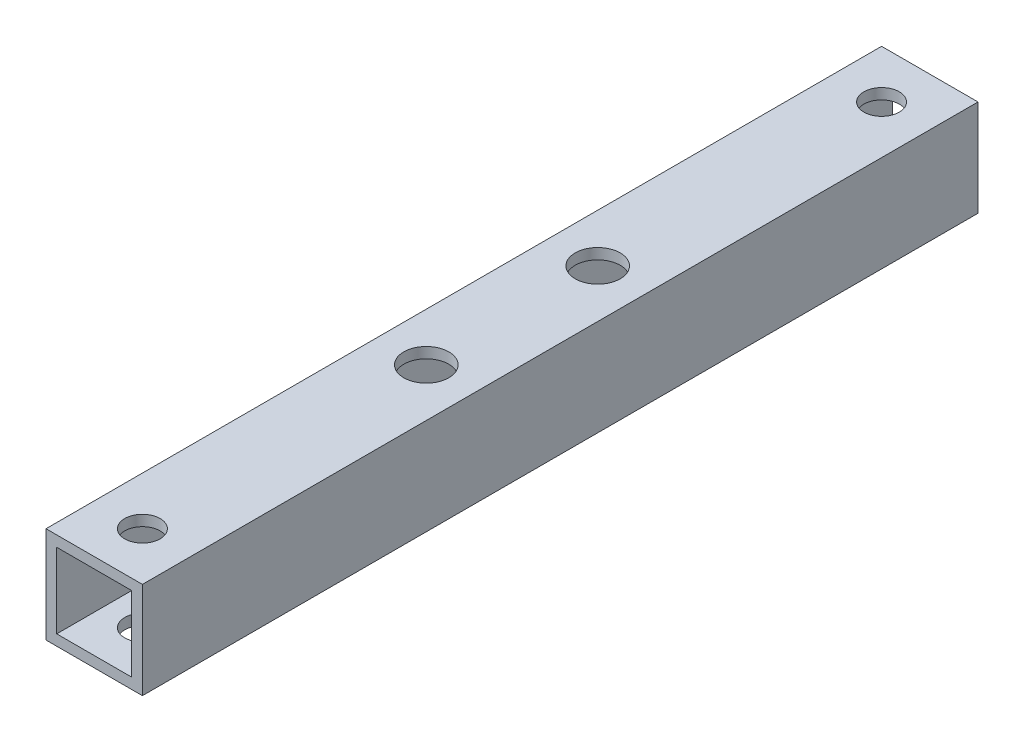
ISO-10303-21;
HEADER;
FILE_DESCRIPTION(('STEP AP214'),'2;1');
FILE_NAME('part.step','',(''),(''),'','','');
FILE_SCHEMA(('AUTOMOTIVE_DESIGN { 1 0 10303 214 1 1 1 1 }'));
ENDSEC;
DATA;
#1=APPLICATION_CONTEXT('core data for automotive mechanical design processes');
#2=APPLICATION_PROTOCOL_DEFINITION('international standard','automotive_design',2000,#1);
#3=PRODUCT_CONTEXT('',#1,'mechanical');
#4=PRODUCT('Part','Part','',(#3));
#5=PRODUCT_RELATED_PRODUCT_CATEGORY('part','',(#4));
#6=PRODUCT_DEFINITION_FORMATION('','',#4);
#7=PRODUCT_DEFINITION_CONTEXT('part definition',#1,'design');
#8=PRODUCT_DEFINITION('design','',#6,#7);
#9=PRODUCT_DEFINITION_SHAPE('','',#8);
#10=(LENGTH_UNIT() NAMED_UNIT(*) SI_UNIT(.MILLI.,.METRE.));
#11=(NAMED_UNIT(*) PLANE_ANGLE_UNIT() SI_UNIT($,.RADIAN.));
#12=(NAMED_UNIT(*) SI_UNIT($,.STERADIAN.) SOLID_ANGLE_UNIT());
#13=UNCERTAINTY_MEASURE_WITH_UNIT(LENGTH_MEASURE(1.E-05),#10,'distance_accuracy_value','');
#14=(GEOMETRIC_REPRESENTATION_CONTEXT(3) GLOBAL_UNCERTAINTY_ASSIGNED_CONTEXT((#13)) GLOBAL_UNIT_ASSIGNED_CONTEXT((#10,
#11,#12)) REPRESENTATION_CONTEXT('',''));
#15=CARTESIAN_POINT('',(0.,0.,0.));
#16=DIRECTION('',(0.,0.,1.));
#17=DIRECTION('',(1.,0.,0.));
#18=AXIS2_PLACEMENT_3D('',#15,#16,#17);
#19=CARTESIAN_POINT('',(4.5,4.5,78.));
#20=DIRECTION('',(-1.,0.,0.));
#21=DIRECTION('',(0.,0.,1.));
#22=AXIS2_PLACEMENT_3D('',#19,#20,#21);
#23=PLANE('',#22);
#24=DIRECTION('',(0.,1.,0.));
#25=VECTOR('',#24,1.);
#26=CARTESIAN_POINT('',(4.5,4.5,0.));
#27=LINE('',#26,#25);
#28=CARTESIAN_POINT('',(4.5,-4.5,0.));
#29=VERTEX_POINT('',#28);
#30=CARTESIAN_POINT('',(4.5,4.5,0.));
#31=VERTEX_POINT('',#30);
#32=EDGE_CURVE('E125',#29,#31,#27,.T.);
#33=ORIENTED_EDGE('',*,*,#32,.T.);
#34=DIRECTION('',(0.,0.,-1.));
#35=VECTOR('',#34,1.);
#36=CARTESIAN_POINT('',(4.5,4.5,78.));
#37=LINE('',#36,#35);
#38=CARTESIAN_POINT('',(4.5,4.5,78.));
#39=VERTEX_POINT('',#38);
#40=EDGE_CURVE('E154',#39,#31,#37,.T.);
#41=ORIENTED_EDGE('',*,*,#40,.F.);
#42=DIRECTION('',(0.,1.,0.));
#43=VECTOR('',#42,1.);
#44=CARTESIAN_POINT('',(4.5,4.5,78.));
#45=LINE('',#44,#43);
#46=CARTESIAN_POINT('',(4.5,-4.5,78.));
#47=VERTEX_POINT('',#46);
#48=EDGE_CURVE('E128',#47,#39,#45,.T.);
#49=ORIENTED_EDGE('',*,*,#48,.F.);
#50=DIRECTION('',(0.,0.,-1.));
#51=VECTOR('',#50,1.);
#52=CARTESIAN_POINT('',(4.5,-4.5,78.));
#53=LINE('',#52,#51);
#54=EDGE_CURVE('E138',#47,#29,#53,.T.);
#55=ORIENTED_EDGE('',*,*,#54,.T.);
#56=EDGE_LOOP('',(#33,#41,#49,#55));
#57=FACE_BOUND('',#56,.T.);
#58=ADVANCED_FACE('F33',(#57),#23,.F.);
#59=CARTESIAN_POINT('',(-4.5,4.5,78.));
#60=DIRECTION('',(0.,-1.,0.));
#61=DIRECTION('',(0.,0.,-1.));
#62=AXIS2_PLACEMENT_3D('',#59,#60,#61);
#63=PLANE('',#62);
#64=CARTESIAN_POINT('',(0.,4.5,31.));
#65=DIRECTION('',(0.,1.,0.));
#66=DIRECTION('',(0.,0.,1.));
#67=AXIS2_PLACEMENT_3D('',#64,#65,#66);
#68=CIRCLE('',#67,2.1);
#69=CARTESIAN_POINT('',(0.,4.5,33.1));
#70=VERTEX_POINT('',#69);
#71=EDGE_CURVE('E174',#70,#70,#68,.T.);
#72=ORIENTED_EDGE('',*,*,#71,.F.);
#73=EDGE_LOOP('',(#72));
#74=FACE_BOUND('',#73,.T.);
#75=CARTESIAN_POINT('',(0.,4.5,47.));
#76=DIRECTION('',(0.,1.,0.));
#77=DIRECTION('',(0.,0.,1.));
#78=AXIS2_PLACEMENT_3D('',#75,#76,#77);
#79=CIRCLE('',#78,2.1);
#80=CARTESIAN_POINT('',(0.,4.5,49.1));
#81=VERTEX_POINT('',#80);
#82=EDGE_CURVE('E181',#81,#81,#79,.T.);
#83=ORIENTED_EDGE('',*,*,#82,.F.);
#84=EDGE_LOOP('',(#83));
#85=FACE_BOUND('',#84,.T.);
#86=CARTESIAN_POINT('',(0.,4.5,4.5));
#87=DIRECTION('',(0.,1.,0.));
#88=DIRECTION('',(0.,0.,1.));
#89=AXIS2_PLACEMENT_3D('',#86,#87,#88);
#90=CIRCLE('',#89,1.65);
#91=CARTESIAN_POINT('',(0.,4.5,6.15));
#92=VERTEX_POINT('',#91);
#93=EDGE_CURVE('E166',#92,#92,#90,.T.);
#94=ORIENTED_EDGE('',*,*,#93,.F.);
#95=EDGE_LOOP('',(#94));
#96=FACE_BOUND('',#95,.T.);
#97=CARTESIAN_POINT('',(0.,4.5,73.5));
#98=DIRECTION('',(0.,1.,0.));
#99=DIRECTION('',(0.,0.,1.));
#100=AXIS2_PLACEMENT_3D('',#97,#98,#99);
#101=CIRCLE('',#100,1.65);
#102=CARTESIAN_POINT('',(0.,4.5,75.15));
#103=VERTEX_POINT('',#102);
#104=EDGE_CURVE('E196',#103,#103,#101,.T.);
#105=ORIENTED_EDGE('',*,*,#104,.F.);
#106=EDGE_LOOP('',(#105));
#107=FACE_BOUND('',#106,.T.);
#108=DIRECTION('',(-1.,0.,0.));
#109=VECTOR('',#108,1.);
#110=CARTESIAN_POINT('',(-4.5,4.5,0.));
#111=LINE('',#110,#109);
#112=CARTESIAN_POINT('',(-4.5,4.5,0.));
#113=VERTEX_POINT('',#112);
#114=EDGE_CURVE('E141',#31,#113,#111,.T.);
#115=ORIENTED_EDGE('',*,*,#114,.T.);
#116=DIRECTION('',(0.,0.,-1.));
#117=VECTOR('',#116,1.);
#118=CARTESIAN_POINT('',(-4.5,4.5,78.));
#119=LINE('',#118,#117);
#120=CARTESIAN_POINT('',(-4.5,4.5,78.));
#121=VERTEX_POINT('',#120);
#122=EDGE_CURVE('E151',#121,#113,#119,.T.);
#123=ORIENTED_EDGE('',*,*,#122,.F.);
#124=DIRECTION('',(-1.,0.,0.));
#125=VECTOR('',#124,1.);
#126=CARTESIAN_POINT('',(-4.5,4.5,78.));
#127=LINE('',#126,#125);
#128=EDGE_CURVE('E131',#39,#121,#127,.T.);
#129=ORIENTED_EDGE('',*,*,#128,.F.);
#130=ORIENTED_EDGE('',*,*,#40,.T.);
#131=EDGE_LOOP('',(#115,#123,#129,#130));
#132=FACE_BOUND('',#131,.T.);
#133=ADVANCED_FACE('F236',(#74,#85,#96,#107,#132),#63,.F.);
#134=CARTESIAN_POINT('',(-4.5,4.5,78.));
#135=DIRECTION('',(1.,0.,0.));
#136=DIRECTION('',(0.,1.,0.));
#137=AXIS2_PLACEMENT_3D('',#134,#135,#136);
#138=PLANE('',#137);
#139=DIRECTION('',(0.,-1.,0.));
#140=VECTOR('',#139,1.);
#141=CARTESIAN_POINT('',(-4.5,4.5,0.));
#142=LINE('',#141,#140);
#143=CARTESIAN_POINT('',(-4.5,-4.5,0.));
#144=VERTEX_POINT('',#143);
#145=EDGE_CURVE('E143',#113,#144,#142,.T.);
#146=ORIENTED_EDGE('',*,*,#145,.T.);
#147=DIRECTION('',(0.,0.,-1.));
#148=VECTOR('',#147,1.);
#149=CARTESIAN_POINT('',(-4.5,-4.5,78.));
#150=LINE('',#149,#148);
#151=CARTESIAN_POINT('',(-4.5,-4.5,78.));
#152=VERTEX_POINT('',#151);
#153=EDGE_CURVE('E148',#152,#144,#150,.T.);
#154=ORIENTED_EDGE('',*,*,#153,.F.);
#155=DIRECTION('',(0.,-1.,0.));
#156=VECTOR('',#155,1.);
#157=CARTESIAN_POINT('',(-4.5,4.5,78.));
#158=LINE('',#157,#156);
#159=EDGE_CURVE('E134',#121,#152,#158,.T.);
#160=ORIENTED_EDGE('',*,*,#159,.F.);
#161=ORIENTED_EDGE('',*,*,#122,.T.);
#162=EDGE_LOOP('',(#146,#154,#160,#161));
#163=FACE_BOUND('',#162,.T.);
#164=ADVANCED_FACE('F241',(#163),#138,.F.);
#165=CARTESIAN_POINT('',(-4.5,-4.5,78.));
#166=DIRECTION('',(0.,1.,0.));
#167=DIRECTION('',(0.,0.,1.));
#168=AXIS2_PLACEMENT_3D('',#165,#166,#167);
#169=PLANE('',#168);
#170=CARTESIAN_POINT('',(0.,-4.5,31.));
#171=DIRECTION('',(0.,1.,0.));
#172=DIRECTION('',(0.,0.,1.));
#173=AXIS2_PLACEMENT_3D('',#170,#171,#172);
#174=CIRCLE('',#173,2.1);
#175=CARTESIAN_POINT('',(0.,-4.5,33.1));
#176=VERTEX_POINT('',#175);
#177=EDGE_CURVE('E193',#176,#176,#174,.T.);
#178=ORIENTED_EDGE('',*,*,#177,.T.);
#179=EDGE_LOOP('',(#178));
#180=FACE_BOUND('',#179,.T.);
#181=CARTESIAN_POINT('',(0.,-4.5,47.));
#182=DIRECTION('',(0.,1.,0.));
#183=DIRECTION('',(0.,0.,1.));
#184=AXIS2_PLACEMENT_3D('',#181,#182,#183);
#185=CIRCLE('',#184,2.1);
#186=CARTESIAN_POINT('',(0.,-4.5,49.1));
#187=VERTEX_POINT('',#186);
#188=EDGE_CURVE('E178',#187,#187,#185,.T.);
#189=ORIENTED_EDGE('',*,*,#188,.T.);
#190=EDGE_LOOP('',(#189));
#191=FACE_BOUND('',#190,.T.);
#192=CARTESIAN_POINT('',(0.,-4.5,4.5));
#193=DIRECTION('',(0.,1.,0.));
#194=DIRECTION('',(0.,0.,1.));
#195=AXIS2_PLACEMENT_3D('',#192,#193,#194);
#196=CIRCLE('',#195,1.65);
#197=CARTESIAN_POINT('',(0.,-4.5,6.15));
#198=VERTEX_POINT('',#197);
#199=EDGE_CURVE('E207',#198,#198,#196,.T.);
#200=ORIENTED_EDGE('',*,*,#199,.T.);
#201=EDGE_LOOP('',(#200));
#202=FACE_BOUND('',#201,.T.);
#203=CARTESIAN_POINT('',(0.,-4.5,73.5));
#204=DIRECTION('',(0.,1.,0.));
#205=DIRECTION('',(0.,0.,1.));
#206=AXIS2_PLACEMENT_3D('',#203,#204,#205);
#207=CIRCLE('',#206,1.65);
#208=CARTESIAN_POINT('',(0.,-4.5,75.15));
#209=VERTEX_POINT('',#208);
#210=EDGE_CURVE('E170',#209,#209,#207,.T.);
#211=ORIENTED_EDGE('',*,*,#210,.T.);
#212=EDGE_LOOP('',(#211));
#213=FACE_BOUND('',#212,.T.);
#214=DIRECTION('',(1.,0.,0.));
#215=VECTOR('',#214,1.);
#216=CARTESIAN_POINT('',(-4.5,-4.5,0.));
#217=LINE('',#216,#215);
#218=EDGE_CURVE('E132',#144,#29,#217,.T.);
#219=ORIENTED_EDGE('',*,*,#218,.T.);
#220=ORIENTED_EDGE('',*,*,#54,.F.);
#221=DIRECTION('',(1.,0.,0.));
#222=VECTOR('',#221,1.);
#223=CARTESIAN_POINT('',(-4.5,-4.5,78.));
#224=LINE('',#223,#222);
#225=EDGE_CURVE('E136',#152,#47,#224,.T.);
#226=ORIENTED_EDGE('',*,*,#225,.F.);
#227=ORIENTED_EDGE('',*,*,#153,.T.);
#228=EDGE_LOOP('',(#219,#220,#226,#227));
#229=FACE_BOUND('',#228,.T.);
#230=ADVANCED_FACE('F211',(#180,#191,#202,#213,#229),#169,.F.);
#231=CARTESIAN_POINT('',(0.,0.,78.));
#232=DIRECTION('',(0.,0.,1.));
#233=DIRECTION('',(1.,0.,0.));
#234=AXIS2_PLACEMENT_3D('',#231,#232,#233);
#235=PLANE('',#234);
#236=DIRECTION('',(0.,1.,0.));
#237=VECTOR('',#236,1.);
#238=CARTESIAN_POINT('',(3.5,3.5,78.));
#239=LINE('',#238,#237);
#240=CARTESIAN_POINT('',(3.5,-3.5,78.));
#241=VERTEX_POINT('',#240);
#242=CARTESIAN_POINT('',(3.5,3.5,78.));
#243=VERTEX_POINT('',#242);
#244=EDGE_CURVE('E49',#241,#243,#239,.T.);
#245=ORIENTED_EDGE('',*,*,#244,.F.);
#246=DIRECTION('',(1.,0.,0.));
#247=VECTOR('',#246,1.);
#248=CARTESIAN_POINT('',(-3.5,-3.5,78.));
#249=LINE('',#248,#247);
#250=CARTESIAN_POINT('',(-3.5,-3.5,78.));
#251=VERTEX_POINT('',#250);
#252=EDGE_CURVE('E118',#251,#241,#249,.T.);
#253=ORIENTED_EDGE('',*,*,#252,.F.);
#254=DIRECTION('',(0.,-1.,0.));
#255=VECTOR('',#254,1.);
#256=CARTESIAN_POINT('',(-3.5,3.5,78.));
#257=LINE('',#256,#255);
#258=CARTESIAN_POINT('',(-3.5,3.5,78.));
#259=VERTEX_POINT('',#258);
#260=EDGE_CURVE('E102',#259,#251,#257,.T.);
#261=ORIENTED_EDGE('',*,*,#260,.F.);
#262=DIRECTION('',(-1.,0.,0.));
#263=VECTOR('',#262,1.);
#264=CARTESIAN_POINT('',(-3.5,3.5,78.));
#265=LINE('',#264,#263);
#266=EDGE_CURVE('E111',#243,#259,#265,.T.);
#267=ORIENTED_EDGE('',*,*,#266,.F.);
#268=EDGE_LOOP('',(#245,#253,#261,#267));
#269=FACE_BOUND('',#268,.T.);
#270=ORIENTED_EDGE('',*,*,#48,.T.);
#271=ORIENTED_EDGE('',*,*,#128,.T.);
#272=ORIENTED_EDGE('',*,*,#159,.T.);
#273=ORIENTED_EDGE('',*,*,#225,.T.);
#274=EDGE_LOOP('',(#270,#271,#272,#273));
#275=FACE_BOUND('',#274,.T.);
#276=ADVANCED_FACE('F115',(#269,#275),#235,.T.);
#277=CARTESIAN_POINT('',(0.,0.,0.));
#278=DIRECTION('',(0.,0.,1.));
#279=DIRECTION('',(1.,0.,0.));
#280=AXIS2_PLACEMENT_3D('',#277,#278,#279);
#281=PLANE('',#280);
#282=DIRECTION('',(1.,0.,0.));
#283=VECTOR('',#282,1.);
#284=CARTESIAN_POINT('',(0.,-3.5,0.));
#285=LINE('',#284,#283);
#286=CARTESIAN_POINT('',(-3.5,-3.5,0.));
#287=VERTEX_POINT('',#286);
#288=CARTESIAN_POINT('',(3.5,-3.5,0.));
#289=VERTEX_POINT('',#288);
#290=EDGE_CURVE('E41',#287,#289,#285,.T.);
#291=ORIENTED_EDGE('',*,*,#290,.T.);
#292=DIRECTION('',(0.,1.,0.));
#293=VECTOR('',#292,1.);
#294=CARTESIAN_POINT('',(3.5,0.,0.));
#295=LINE('',#294,#293);
#296=CARTESIAN_POINT('',(3.5,3.5,0.));
#297=VERTEX_POINT('',#296);
#298=EDGE_CURVE('E11',#289,#297,#295,.T.);
#299=ORIENTED_EDGE('',*,*,#298,.T.);
#300=DIRECTION('',(-1.,0.,0.));
#301=VECTOR('',#300,1.);
#302=CARTESIAN_POINT('',(0.,3.5,0.));
#303=LINE('',#302,#301);
#304=CARTESIAN_POINT('',(-3.5,3.5,0.));
#305=VERTEX_POINT('',#304);
#306=EDGE_CURVE('E157',#297,#305,#303,.T.);
#307=ORIENTED_EDGE('',*,*,#306,.T.);
#308=DIRECTION('',(0.,-1.,0.));
#309=VECTOR('',#308,1.);
#310=CARTESIAN_POINT('',(-3.5,0.,0.));
#311=LINE('',#310,#309);
#312=EDGE_CURVE('E105',#305,#287,#311,.T.);
#313=ORIENTED_EDGE('',*,*,#312,.T.);
#314=EDGE_LOOP('',(#291,#299,#307,#313));
#315=FACE_BOUND('',#314,.T.);
#316=ORIENTED_EDGE('',*,*,#32,.F.);
#317=ORIENTED_EDGE('',*,*,#218,.F.);
#318=ORIENTED_EDGE('',*,*,#145,.F.);
#319=ORIENTED_EDGE('',*,*,#114,.F.);
#320=EDGE_LOOP('',(#316,#317,#318,#319));
#321=FACE_BOUND('',#320,.T.);
#322=ADVANCED_FACE('F249',(#315,#321),#281,.F.);
#323=CARTESIAN_POINT('',(3.5,3.5,-12.));
#324=DIRECTION('',(1.,0.,0.));
#325=DIRECTION('',(0.,1.,0.));
#326=AXIS2_PLACEMENT_3D('',#323,#324,#325);
#327=PLANE('',#326);
#328=DIRECTION('',(0.,0.,1.));
#329=VECTOR('',#328,1.);
#330=CARTESIAN_POINT('',(3.5,-3.5,-12.));
#331=LINE('',#330,#329);
#332=EDGE_CURVE('E123',#289,#241,#331,.T.);
#333=ORIENTED_EDGE('',*,*,#332,.T.);
#334=ORIENTED_EDGE('',*,*,#244,.T.);
#335=DIRECTION('',(0.,0.,1.));
#336=VECTOR('',#335,1.);
#337=CARTESIAN_POINT('',(3.5,3.5,-12.));
#338=LINE('',#337,#336);
#339=EDGE_CURVE('E108',#297,#243,#338,.T.);
#340=ORIENTED_EDGE('',*,*,#339,.F.);
#341=ORIENTED_EDGE('',*,*,#298,.F.);
#342=EDGE_LOOP('',(#333,#334,#340,#341));
#343=FACE_BOUND('',#342,.T.);
#344=ADVANCED_FACE('F268',(#343),#327,.F.);
#345=CARTESIAN_POINT('',(-3.5,-3.5,-12.));
#346=DIRECTION('',(0.,-1.,0.));
#347=DIRECTION('',(0.,0.,-1.));
#348=AXIS2_PLACEMENT_3D('',#345,#346,#347);
#349=PLANE('',#348);
#350=CARTESIAN_POINT('',(0.,-3.5,31.));
#351=DIRECTION('',(0.,-1.,0.));
#352=DIRECTION('',(0.,0.,-1.));
#353=AXIS2_PLACEMENT_3D('',#350,#351,#352);
#354=CIRCLE('',#353,2.1);
#355=CARTESIAN_POINT('',(0.,-3.5,28.9));
#356=VERTEX_POINT('',#355);
#357=EDGE_CURVE('E190',#356,#356,#354,.T.);
#358=ORIENTED_EDGE('',*,*,#357,.T.);
#359=EDGE_LOOP('',(#358));
#360=FACE_BOUND('',#359,.T.);
#361=CARTESIAN_POINT('',(0.,-3.5,47.));
#362=DIRECTION('',(0.,-1.,0.));
#363=DIRECTION('',(0.,0.,-1.));
#364=AXIS2_PLACEMENT_3D('',#361,#362,#363);
#365=CIRCLE('',#364,2.1);
#366=CARTESIAN_POINT('',(0.,-3.5,44.9));
#367=VERTEX_POINT('',#366);
#368=EDGE_CURVE('E173',#367,#367,#365,.T.);
#369=ORIENTED_EDGE('',*,*,#368,.T.);
#370=EDGE_LOOP('',(#369));
#371=FACE_BOUND('',#370,.T.);
#372=CARTESIAN_POINT('',(0.,-3.5,4.5));
#373=DIRECTION('',(0.,-1.,0.));
#374=DIRECTION('',(0.,0.,-1.));
#375=AXIS2_PLACEMENT_3D('',#372,#373,#374);
#376=CIRCLE('',#375,1.65);
#377=CARTESIAN_POINT('',(0.,-3.5,2.85));
#378=VERTEX_POINT('',#377);
#379=EDGE_CURVE('E169',#378,#378,#376,.T.);
#380=ORIENTED_EDGE('',*,*,#379,.T.);
#381=EDGE_LOOP('',(#380));
#382=FACE_BOUND('',#381,.T.);
#383=CARTESIAN_POINT('',(0.,-3.5,73.5));
#384=DIRECTION('',(0.,-1.,0.));
#385=DIRECTION('',(0.,0.,-1.));
#386=AXIS2_PLACEMENT_3D('',#383,#384,#385);
#387=CIRCLE('',#386,1.65);
#388=CARTESIAN_POINT('',(0.,-3.5,71.85));
#389=VERTEX_POINT('',#388);
#390=EDGE_CURVE('E165',#389,#389,#387,.T.);
#391=ORIENTED_EDGE('',*,*,#390,.T.);
#392=EDGE_LOOP('',(#391));
#393=FACE_BOUND('',#392,.T.);
#394=DIRECTION('',(0.,0.,1.));
#395=VECTOR('',#394,1.);
#396=CARTESIAN_POINT('',(-3.5,-3.5,-12.));
#397=LINE('',#396,#395);
#398=EDGE_CURVE('E107',#287,#251,#397,.T.);
#399=ORIENTED_EDGE('',*,*,#398,.T.);
#400=ORIENTED_EDGE('',*,*,#252,.T.);
#401=ORIENTED_EDGE('',*,*,#332,.F.);
#402=ORIENTED_EDGE('',*,*,#290,.F.);
#403=EDGE_LOOP('',(#399,#400,#401,#402));
#404=FACE_BOUND('',#403,.T.);
#405=ADVANCED_FACE('F274',(#360,#371,#382,#393,#404),#349,.F.);
#406=CARTESIAN_POINT('',(-3.5,3.5,-12.));
#407=DIRECTION('',(-1.,0.,0.));
#408=DIRECTION('',(0.,-1.,0.));
#409=AXIS2_PLACEMENT_3D('',#406,#407,#408);
#410=PLANE('',#409);
#411=DIRECTION('',(0.,0.,1.));
#412=VECTOR('',#411,1.);
#413=CARTESIAN_POINT('',(-3.5,3.5,-12.));
#414=LINE('',#413,#412);
#415=EDGE_CURVE('E57',#305,#259,#414,.T.);
#416=ORIENTED_EDGE('',*,*,#415,.T.);
#417=ORIENTED_EDGE('',*,*,#260,.T.);
#418=ORIENTED_EDGE('',*,*,#398,.F.);
#419=ORIENTED_EDGE('',*,*,#312,.F.);
#420=EDGE_LOOP('',(#416,#417,#418,#419));
#421=FACE_BOUND('',#420,.T.);
#422=ADVANCED_FACE('F99',(#421),#410,.F.);
#423=CARTESIAN_POINT('',(-3.5,3.5,-12.));
#424=DIRECTION('',(0.,1.,0.));
#425=DIRECTION('',(0.,0.,1.));
#426=AXIS2_PLACEMENT_3D('',#423,#424,#425);
#427=PLANE('',#426);
#428=CARTESIAN_POINT('',(0.,3.5,31.));
#429=DIRECTION('',(0.,1.,0.));
#430=DIRECTION('',(0.,0.,1.));
#431=AXIS2_PLACEMENT_3D('',#428,#429,#430);
#432=CIRCLE('',#431,2.1);
#433=CARTESIAN_POINT('',(0.,3.5,33.1));
#434=VERTEX_POINT('',#433);
#435=EDGE_CURVE('E36',#434,#434,#432,.T.);
#436=ORIENTED_EDGE('',*,*,#435,.T.);
#437=EDGE_LOOP('',(#436));
#438=FACE_BOUND('',#437,.T.);
#439=CARTESIAN_POINT('',(0.,3.5,47.));
#440=DIRECTION('',(0.,1.,0.));
#441=DIRECTION('',(0.,0.,1.));
#442=AXIS2_PLACEMENT_3D('',#439,#440,#441);
#443=CIRCLE('',#442,2.1);
#444=CARTESIAN_POINT('',(0.,3.5,49.1));
#445=VERTEX_POINT('',#444);
#446=EDGE_CURVE('E171',#445,#445,#443,.T.);
#447=ORIENTED_EDGE('',*,*,#446,.T.);
#448=EDGE_LOOP('',(#447));
#449=FACE_BOUND('',#448,.T.);
#450=CARTESIAN_POINT('',(0.,3.5,4.5));
#451=DIRECTION('',(0.,1.,0.));
#452=DIRECTION('',(0.,0.,1.));
#453=AXIS2_PLACEMENT_3D('',#450,#451,#452);
#454=CIRCLE('',#453,1.65);
#455=CARTESIAN_POINT('',(0.,3.5,6.15));
#456=VERTEX_POINT('',#455);
#457=EDGE_CURVE('E167',#456,#456,#454,.T.);
#458=ORIENTED_EDGE('',*,*,#457,.T.);
#459=EDGE_LOOP('',(#458));
#460=FACE_BOUND('',#459,.T.);
#461=CARTESIAN_POINT('',(0.,3.5,73.5));
#462=DIRECTION('',(0.,1.,0.));
#463=DIRECTION('',(0.,0.,1.));
#464=AXIS2_PLACEMENT_3D('',#461,#462,#463);
#465=CIRCLE('',#464,1.65);
#466=CARTESIAN_POINT('',(0.,3.5,75.15));
#467=VERTEX_POINT('',#466);
#468=EDGE_CURVE('E162',#467,#467,#465,.T.);
#469=ORIENTED_EDGE('',*,*,#468,.T.);
#470=EDGE_LOOP('',(#469));
#471=FACE_BOUND('',#470,.T.);
#472=ORIENTED_EDGE('',*,*,#339,.T.);
#473=ORIENTED_EDGE('',*,*,#266,.T.);
#474=ORIENTED_EDGE('',*,*,#415,.F.);
#475=ORIENTED_EDGE('',*,*,#306,.F.);
#476=EDGE_LOOP('',(#472,#473,#474,#475));
#477=FACE_BOUND('',#476,.T.);
#478=ADVANCED_FACE('F112',(#438,#449,#460,#471,#477),#427,.F.);
#479=CARTESIAN_POINT('',(0.,-70.5,73.5));
#480=DIRECTION('',(0.,1.,0.));
#481=DIRECTION('',(0.,0.,1.));
#482=AXIS2_PLACEMENT_3D('',#479,#480,#481);
#483=CYLINDRICAL_SURFACE('',#482,1.65);
#484=ORIENTED_EDGE('',*,*,#104,.T.);
#485=EDGE_LOOP('',(#484));
#486=FACE_BOUND('',#485,.T.);
#487=ORIENTED_EDGE('',*,*,#468,.F.);
#488=EDGE_LOOP('',(#487));
#489=FACE_BOUND('',#488,.T.);
#490=ADVANCED_FACE('F231',(#486,#489),#483,.F.);
#491=CARTESIAN_POINT('',(0.,-70.5,4.5));
#492=DIRECTION('',(0.,1.,0.));
#493=DIRECTION('',(0.,0.,1.));
#494=AXIS2_PLACEMENT_3D('',#491,#492,#493);
#495=CYLINDRICAL_SURFACE('',#494,1.65);
#496=ORIENTED_EDGE('',*,*,#93,.T.);
#497=EDGE_LOOP('',(#496));
#498=FACE_BOUND('',#497,.T.);
#499=ORIENTED_EDGE('',*,*,#457,.F.);
#500=EDGE_LOOP('',(#499));
#501=FACE_BOUND('',#500,.T.);
#502=ADVANCED_FACE('F220',(#498,#501),#495,.F.);
#503=ORIENTED_EDGE('',*,*,#390,.F.);
#504=EDGE_LOOP('',(#503));
#505=FACE_BOUND('',#504,.T.);
#506=ORIENTED_EDGE('',*,*,#210,.F.);
#507=EDGE_LOOP('',(#506));
#508=FACE_BOUND('',#507,.T.);
#509=ADVANCED_FACE('F217',(#505,#508),#483,.F.);
#510=ORIENTED_EDGE('',*,*,#379,.F.);
#511=EDGE_LOOP('',(#510));
#512=FACE_BOUND('',#511,.T.);
#513=ORIENTED_EDGE('',*,*,#199,.F.);
#514=EDGE_LOOP('',(#513));
#515=FACE_BOUND('',#514,.T.);
#516=ADVANCED_FACE('F214',(#512,#515),#495,.F.);
#517=CARTESIAN_POINT('',(0.,-70.5,47.));
#518=DIRECTION('',(0.,1.,0.));
#519=DIRECTION('',(0.,0.,1.));
#520=AXIS2_PLACEMENT_3D('',#517,#518,#519);
#521=CYLINDRICAL_SURFACE('',#520,2.1);
#522=ORIENTED_EDGE('',*,*,#82,.T.);
#523=EDGE_LOOP('',(#522));
#524=FACE_BOUND('',#523,.T.);
#525=ORIENTED_EDGE('',*,*,#446,.F.);
#526=EDGE_LOOP('',(#525));
#527=FACE_BOUND('',#526,.T.);
#528=ADVANCED_FACE('F216',(#524,#527),#521,.F.);
#529=CARTESIAN_POINT('',(0.,-70.5,31.));
#530=DIRECTION('',(0.,1.,0.));
#531=DIRECTION('',(0.,0.,1.));
#532=AXIS2_PLACEMENT_3D('',#529,#530,#531);
#533=CYLINDRICAL_SURFACE('',#532,2.1);
#534=ORIENTED_EDGE('',*,*,#71,.T.);
#535=EDGE_LOOP('',(#534));
#536=FACE_BOUND('',#535,.T.);
#537=ORIENTED_EDGE('',*,*,#435,.F.);
#538=EDGE_LOOP('',(#537));
#539=FACE_BOUND('',#538,.T.);
#540=ADVANCED_FACE('F225',(#536,#539),#533,.F.);
#541=ORIENTED_EDGE('',*,*,#368,.F.);
#542=EDGE_LOOP('',(#541));
#543=FACE_BOUND('',#542,.T.);
#544=ORIENTED_EDGE('',*,*,#188,.F.);
#545=EDGE_LOOP('',(#544));
#546=FACE_BOUND('',#545,.T.);
#547=ADVANCED_FACE('F228',(#543,#546),#521,.F.);
#548=ORIENTED_EDGE('',*,*,#357,.F.);
#549=EDGE_LOOP('',(#548));
#550=FACE_BOUND('',#549,.T.);
#551=ORIENTED_EDGE('',*,*,#177,.F.);
#552=EDGE_LOOP('',(#551));
#553=FACE_BOUND('',#552,.T.);
#554=ADVANCED_FACE('F297',(#550,#553),#533,.F.);
#555=CLOSED_SHELL('',(#58,#133,#164,#230,#276,#322,#344,#405,#422,#478,#490,#502,#509,#516,#528,
#540,#547,#554));
#556=MANIFOLD_SOLID_BREP('B2',#555);
#557=ADVANCED_BREP_SHAPE_REPRESENTATION('',(#18,#556),#14);
#558=SHAPE_DEFINITION_REPRESENTATION(#9,#557);
ENDSEC;
END-ISO-10303-21;
